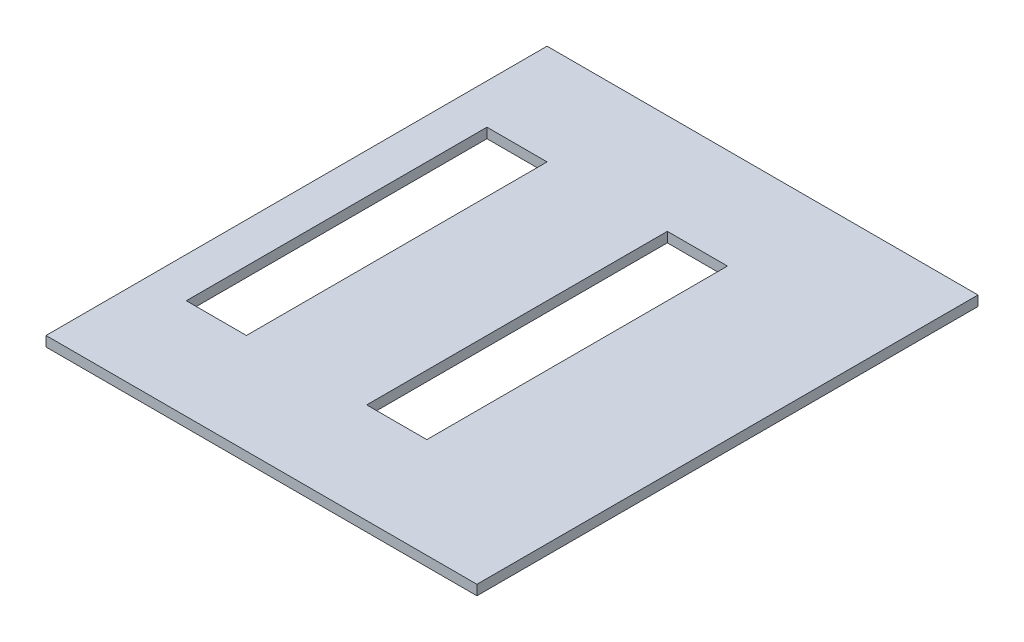
ISO-10303-21;
HEADER;
FILE_DESCRIPTION(('STEP AP214'),'2;1');
FILE_NAME('part.step','',(''),(''),'','','');
FILE_SCHEMA(('AUTOMOTIVE_DESIGN { 1 0 10303 214 1 1 1 1 }'));
ENDSEC;
DATA;
#1=APPLICATION_CONTEXT('core data for automotive mechanical design processes');
#2=APPLICATION_PROTOCOL_DEFINITION('international standard','automotive_design',2000,#1);
#3=PRODUCT_CONTEXT('',#1,'mechanical');
#4=PRODUCT('Part','Part','',(#3));
#5=PRODUCT_RELATED_PRODUCT_CATEGORY('part','',(#4));
#6=PRODUCT_DEFINITION_FORMATION('','',#4);
#7=PRODUCT_DEFINITION_CONTEXT('part definition',#1,'design');
#8=PRODUCT_DEFINITION('design','',#6,#7);
#9=PRODUCT_DEFINITION_SHAPE('','',#8);
#10=(LENGTH_UNIT() NAMED_UNIT(*) SI_UNIT(.MILLI.,.METRE.));
#11=(NAMED_UNIT(*) PLANE_ANGLE_UNIT() SI_UNIT($,.RADIAN.));
#12=(NAMED_UNIT(*) SI_UNIT($,.STERADIAN.) SOLID_ANGLE_UNIT());
#13=UNCERTAINTY_MEASURE_WITH_UNIT(LENGTH_MEASURE(1.E-05),#10,'distance_accuracy_value','');
#14=(GEOMETRIC_REPRESENTATION_CONTEXT(3) GLOBAL_UNCERTAINTY_ASSIGNED_CONTEXT((#13)) GLOBAL_UNIT_ASSIGNED_CONTEXT((#10,
#11,#12)) REPRESENTATION_CONTEXT('',''));
#15=CARTESIAN_POINT('',(0.,0.,0.));
#16=DIRECTION('',(0.,0.,1.));
#17=DIRECTION('',(1.,0.,0.));
#18=AXIS2_PLACEMENT_3D('',#15,#16,#17);
#19=CARTESIAN_POINT('',(1092.2,50.8,-1270.));
#20=DIRECTION('',(-1.,0.,0.));
#21=DIRECTION('',(0.,0.,1.));
#22=AXIS2_PLACEMENT_3D('',#19,#20,#21);
#23=PLANE('',#22);
#24=DIRECTION('',(0.,0.,-1.));
#25=VECTOR('',#24,1.);
#26=CARTESIAN_POINT('',(1092.2,0.,-1270.));
#27=LINE('',#26,#25);
#28=CARTESIAN_POINT('',(1092.2,0.,1270.));
#29=VERTEX_POINT('',#28);
#30=CARTESIAN_POINT('',(1092.2,0.,-1270.));
#31=VERTEX_POINT('',#30);
#32=EDGE_CURVE('E161',#29,#31,#27,.T.);
#33=ORIENTED_EDGE('',*,*,#32,.T.);
#34=DIRECTION('',(0.,-1.,0.));
#35=VECTOR('',#34,1.);
#36=CARTESIAN_POINT('',(1092.2,50.8,-1270.));
#37=LINE('',#36,#35);
#38=CARTESIAN_POINT('',(1092.2,50.8,-1270.));
#39=VERTEX_POINT('',#38);
#40=EDGE_CURVE('E11',#39,#31,#37,.T.);
#41=ORIENTED_EDGE('',*,*,#40,.F.);
#42=DIRECTION('',(0.,0.,-1.));
#43=VECTOR('',#42,1.);
#44=CARTESIAN_POINT('',(1092.2,50.8,-1270.));
#45=LINE('',#44,#43);
#46=CARTESIAN_POINT('',(1092.2,50.8,1270.));
#47=VERTEX_POINT('',#46);
#48=EDGE_CURVE('E190',#47,#39,#45,.T.);
#49=ORIENTED_EDGE('',*,*,#48,.F.);
#50=DIRECTION('',(0.,-1.,0.));
#51=VECTOR('',#50,1.);
#52=CARTESIAN_POINT('',(1092.2,50.8,1270.));
#53=LINE('',#52,#51);
#54=EDGE_CURVE('E200',#47,#29,#53,.T.);
#55=ORIENTED_EDGE('',*,*,#54,.T.);
#56=EDGE_LOOP('',(#33,#41,#49,#55));
#57=FACE_BOUND('',#56,.T.);
#58=ADVANCED_FACE('F38',(#57),#23,.F.);
#59=CARTESIAN_POINT('',(-1092.2,50.8,-1270.));
#60=DIRECTION('',(0.,0.,1.));
#61=DIRECTION('',(1.,0.,0.));
#62=AXIS2_PLACEMENT_3D('',#59,#60,#61);
#63=PLANE('',#62);
#64=DIRECTION('',(-1.,0.,0.));
#65=VECTOR('',#64,1.);
#66=CARTESIAN_POINT('',(-1092.2,0.,-1270.));
#67=LINE('',#66,#65);
#68=CARTESIAN_POINT('',(-1092.2,0.,-1270.));
#69=VERTEX_POINT('',#68);
#70=EDGE_CURVE('E203',#31,#69,#67,.T.);
#71=ORIENTED_EDGE('',*,*,#70,.T.);
#72=DIRECTION('',(0.,-1.,0.));
#73=VECTOR('',#72,1.);
#74=CARTESIAN_POINT('',(-1092.2,50.8,-1270.));
#75=LINE('',#74,#73);
#76=CARTESIAN_POINT('',(-1092.2,50.8,-1270.));
#77=VERTEX_POINT('',#76);
#78=EDGE_CURVE('E45',#77,#69,#75,.T.);
#79=ORIENTED_EDGE('',*,*,#78,.F.);
#80=DIRECTION('',(-1.,0.,0.));
#81=VECTOR('',#80,1.);
#82=CARTESIAN_POINT('',(-1092.2,50.8,-1270.));
#83=LINE('',#82,#81);
#84=EDGE_CURVE('E193',#39,#77,#83,.T.);
#85=ORIENTED_EDGE('',*,*,#84,.F.);
#86=ORIENTED_EDGE('',*,*,#40,.T.);
#87=EDGE_LOOP('',(#71,#79,#85,#86));
#88=FACE_BOUND('',#87,.T.);
#89=ADVANCED_FACE('F232',(#88),#63,.F.);
#90=CARTESIAN_POINT('',(-1092.2,50.8,-1270.));
#91=DIRECTION('',(1.,0.,0.));
#92=DIRECTION('',(0.,0.,-1.));
#93=AXIS2_PLACEMENT_3D('',#90,#91,#92);
#94=PLANE('',#93);
#95=DIRECTION('',(0.,0.,1.));
#96=VECTOR('',#95,1.);
#97=CARTESIAN_POINT('',(-1092.2,0.,-1270.));
#98=LINE('',#97,#96);
#99=CARTESIAN_POINT('',(-1092.2,0.,1270.));
#100=VERTEX_POINT('',#99);
#101=EDGE_CURVE('E205',#69,#100,#98,.T.);
#102=ORIENTED_EDGE('',*,*,#101,.T.);
#103=DIRECTION('',(0.,-1.,0.));
#104=VECTOR('',#103,1.);
#105=CARTESIAN_POINT('',(-1092.2,50.8,1270.));
#106=LINE('',#105,#104);
#107=CARTESIAN_POINT('',(-1092.2,50.8,1270.));
#108=VERTEX_POINT('',#107);
#109=EDGE_CURVE('E210',#108,#100,#106,.T.);
#110=ORIENTED_EDGE('',*,*,#109,.F.);
#111=DIRECTION('',(0.,0.,1.));
#112=VECTOR('',#111,1.);
#113=CARTESIAN_POINT('',(-1092.2,50.8,-1270.));
#114=LINE('',#113,#112);
#115=EDGE_CURVE('E196',#77,#108,#114,.T.);
#116=ORIENTED_EDGE('',*,*,#115,.F.);
#117=ORIENTED_EDGE('',*,*,#78,.T.);
#118=EDGE_LOOP('',(#102,#110,#116,#117));
#119=FACE_BOUND('',#118,.T.);
#120=ADVANCED_FACE('F217',(#119),#94,.F.);
#121=CARTESIAN_POINT('',(-1092.2,50.8,1270.));
#122=DIRECTION('',(0.,0.,-1.));
#123=DIRECTION('',(-1.,0.,0.));
#124=AXIS2_PLACEMENT_3D('',#121,#122,#123);
#125=PLANE('',#124);
#126=DIRECTION('',(1.,0.,0.));
#127=VECTOR('',#126,1.);
#128=CARTESIAN_POINT('',(-1092.2,0.,1270.));
#129=LINE('',#128,#127);
#130=EDGE_CURVE('E194',#100,#29,#129,.T.);
#131=ORIENTED_EDGE('',*,*,#130,.T.);
#132=ORIENTED_EDGE('',*,*,#54,.F.);
#133=DIRECTION('',(1.,0.,0.));
#134=VECTOR('',#133,1.);
#135=CARTESIAN_POINT('',(-1092.2,50.8,1270.));
#136=LINE('',#135,#134);
#137=EDGE_CURVE('E198',#108,#47,#136,.T.);
#138=ORIENTED_EDGE('',*,*,#137,.F.);
#139=ORIENTED_EDGE('',*,*,#109,.T.);
#140=EDGE_LOOP('',(#131,#132,#138,#139));
#141=FACE_BOUND('',#140,.T.);
#142=ADVANCED_FACE('F226',(#141),#125,.F.);
#143=CARTESIAN_POINT('',(0.,50.8,0.));
#144=DIRECTION('',(0.,1.,0.));
#145=DIRECTION('',(0.,0.,1.));
#146=AXIS2_PLACEMENT_3D('',#143,#144,#145);
#147=PLANE('',#146);
#148=DIRECTION('',(0.,0.,-1.));
#149=VECTOR('',#148,1.);
#150=CARTESIAN_POINT('',(330.2,50.8,762.));
#151=LINE('',#150,#149);
#152=CARTESIAN_POINT('',(330.2,50.8,762.));
#153=VERTEX_POINT('',#152);
#154=CARTESIAN_POINT('',(330.2,50.8,-762.));
#155=VERTEX_POINT('',#154);
#156=EDGE_CURVE('E52',#153,#155,#151,.T.);
#157=ORIENTED_EDGE('',*,*,#156,.F.);
#158=DIRECTION('',(1.,0.,0.));
#159=VECTOR('',#158,1.);
#160=CARTESIAN_POINT('',(25.3999999999998,50.8,762.));
#161=LINE('',#160,#159);
#162=CARTESIAN_POINT('',(25.3999999999998,50.8,762.));
#163=VERTEX_POINT('',#162);
#164=EDGE_CURVE('E150',#163,#153,#161,.T.);
#165=ORIENTED_EDGE('',*,*,#164,.F.);
#166=DIRECTION('',(0.,0.,1.));
#167=VECTOR('',#166,1.);
#168=CARTESIAN_POINT('',(25.3999999999998,50.8,762.));
#169=LINE('',#168,#167);
#170=CARTESIAN_POINT('',(25.3999999999998,50.8,-762.));
#171=VERTEX_POINT('',#170);
#172=EDGE_CURVE('E133',#171,#163,#169,.T.);
#173=ORIENTED_EDGE('',*,*,#172,.F.);
#174=DIRECTION('',(-1.,0.,0.));
#175=VECTOR('',#174,1.);
#176=CARTESIAN_POINT('',(25.3999999999998,50.8,-762.));
#177=LINE('',#176,#175);
#178=EDGE_CURVE('E143',#155,#171,#177,.T.);
#179=ORIENTED_EDGE('',*,*,#178,.F.);
#180=EDGE_LOOP('',(#157,#165,#173,#179));
#181=FACE_BOUND('',#180,.T.);
#182=DIRECTION('',(0.,0.,-1.));
#183=VECTOR('',#182,1.);
#184=CARTESIAN_POINT('',(-584.2,50.8,762.));
#185=LINE('',#184,#183);
#186=CARTESIAN_POINT('',(-584.2,50.8,762.));
#187=VERTEX_POINT('',#186);
#188=CARTESIAN_POINT('',(-584.2,50.8,-762.));
#189=VERTEX_POINT('',#188);
#190=EDGE_CURVE('E60',#187,#189,#185,.T.);
#191=ORIENTED_EDGE('',*,*,#190,.F.);
#192=DIRECTION('',(1.,0.,0.));
#193=VECTOR('',#192,1.);
#194=CARTESIAN_POINT('',(-889.,50.8,762.));
#195=LINE('',#194,#193);
#196=CARTESIAN_POINT('',(-889.,50.8,762.));
#197=VERTEX_POINT('',#196);
#198=EDGE_CURVE('E179',#197,#187,#195,.T.);
#199=ORIENTED_EDGE('',*,*,#198,.F.);
#200=DIRECTION('',(0.,0.,1.));
#201=VECTOR('',#200,1.);
#202=CARTESIAN_POINT('',(-889.,50.8,762.));
#203=LINE('',#202,#201);
#204=CARTESIAN_POINT('',(-889.,50.8,-762.));
#205=VERTEX_POINT('',#204);
#206=EDGE_CURVE('E176',#205,#197,#203,.T.);
#207=ORIENTED_EDGE('',*,*,#206,.F.);
#208=DIRECTION('',(-1.,0.,0.));
#209=VECTOR('',#208,1.);
#210=CARTESIAN_POINT('',(-889.,50.8,-762.));
#211=LINE('',#210,#209);
#212=EDGE_CURVE('E173',#189,#205,#211,.T.);
#213=ORIENTED_EDGE('',*,*,#212,.F.);
#214=EDGE_LOOP('',(#191,#199,#207,#213));
#215=FACE_BOUND('',#214,.T.);
#216=ORIENTED_EDGE('',*,*,#48,.T.);
#217=ORIENTED_EDGE('',*,*,#84,.T.);
#218=ORIENTED_EDGE('',*,*,#115,.T.);
#219=ORIENTED_EDGE('',*,*,#137,.T.);
#220=EDGE_LOOP('',(#216,#217,#218,#219));
#221=FACE_BOUND('',#220,.T.);
#222=ADVANCED_FACE('F147',(#181,#215,#221),#147,.T.);
#223=CARTESIAN_POINT('',(0.,0.,0.));
#224=DIRECTION('',(0.,1.,0.));
#225=DIRECTION('',(0.,0.,1.));
#226=AXIS2_PLACEMENT_3D('',#223,#224,#225);
#227=PLANE('',#226);
#228=DIRECTION('',(-1.,0.,0.));
#229=VECTOR('',#228,1.);
#230=CARTESIAN_POINT('',(25.3999999999998,0.,762.));
#231=LINE('',#230,#229);
#232=CARTESIAN_POINT('',(330.2,0.,762.));
#233=VERTEX_POINT('',#232);
#234=CARTESIAN_POINT('',(25.3999999999998,0.,762.));
#235=VERTEX_POINT('',#234);
#236=EDGE_CURVE('E276',#233,#235,#231,.T.);
#237=ORIENTED_EDGE('',*,*,#236,.F.);
#238=DIRECTION('',(0.,0.,1.));
#239=VECTOR('',#238,1.);
#240=CARTESIAN_POINT('',(330.2,0.,762.));
#241=LINE('',#240,#239);
#242=CARTESIAN_POINT('',(330.2,0.,-762.));
#243=VERTEX_POINT('',#242);
#244=EDGE_CURVE('E162',#243,#233,#241,.T.);
#245=ORIENTED_EDGE('',*,*,#244,.F.);
#246=DIRECTION('',(1.,0.,0.));
#247=VECTOR('',#246,1.);
#248=CARTESIAN_POINT('',(25.3999999999998,0.,-762.));
#249=LINE('',#248,#247);
#250=CARTESIAN_POINT('',(25.3999999999998,0.,-762.));
#251=VERTEX_POINT('',#250);
#252=EDGE_CURVE('E159',#251,#243,#249,.T.);
#253=ORIENTED_EDGE('',*,*,#252,.F.);
#254=DIRECTION('',(0.,0.,-1.));
#255=VECTOR('',#254,1.);
#256=CARTESIAN_POINT('',(25.3999999999998,0.,762.));
#257=LINE('',#256,#255);
#258=EDGE_CURVE('E136',#235,#251,#257,.T.);
#259=ORIENTED_EDGE('',*,*,#258,.F.);
#260=EDGE_LOOP('',(#237,#245,#253,#259));
#261=FACE_BOUND('',#260,.T.);
#262=DIRECTION('',(-1.,0.,0.));
#263=VECTOR('',#262,1.);
#264=CARTESIAN_POINT('',(-889.,0.,762.));
#265=LINE('',#264,#263);
#266=CARTESIAN_POINT('',(-584.2,0.,762.));
#267=VERTEX_POINT('',#266);
#268=CARTESIAN_POINT('',(-889.,0.,762.));
#269=VERTEX_POINT('',#268);
#270=EDGE_CURVE('E166',#267,#269,#265,.T.);
#271=ORIENTED_EDGE('',*,*,#270,.F.);
#272=DIRECTION('',(0.,0.,1.));
#273=VECTOR('',#272,1.);
#274=CARTESIAN_POINT('',(-584.2,0.,762.));
#275=LINE('',#274,#273);
#276=CARTESIAN_POINT('',(-584.2,0.,-762.));
#277=VERTEX_POINT('',#276);
#278=EDGE_CURVE('E169',#277,#267,#275,.T.);
#279=ORIENTED_EDGE('',*,*,#278,.F.);
#280=DIRECTION('',(1.,0.,0.));
#281=VECTOR('',#280,1.);
#282=CARTESIAN_POINT('',(-889.,0.,-762.));
#283=LINE('',#282,#281);
#284=CARTESIAN_POINT('',(-889.,0.,-762.));
#285=VERTEX_POINT('',#284);
#286=EDGE_CURVE('E171',#285,#277,#283,.T.);
#287=ORIENTED_EDGE('',*,*,#286,.F.);
#288=DIRECTION('',(0.,0.,-1.));
#289=VECTOR('',#288,1.);
#290=CARTESIAN_POINT('',(-889.,0.,762.));
#291=LINE('',#290,#289);
#292=EDGE_CURVE('E163',#269,#285,#291,.T.);
#293=ORIENTED_EDGE('',*,*,#292,.F.);
#294=EDGE_LOOP('',(#271,#279,#287,#293));
#295=FACE_BOUND('',#294,.T.);
#296=ORIENTED_EDGE('',*,*,#32,.F.);
#297=ORIENTED_EDGE('',*,*,#130,.F.);
#298=ORIENTED_EDGE('',*,*,#101,.F.);
#299=ORIENTED_EDGE('',*,*,#70,.F.);
#300=EDGE_LOOP('',(#296,#297,#298,#299));
#301=FACE_BOUND('',#300,.T.);
#302=ADVANCED_FACE('F223',(#261,#295,#301),#227,.F.);
#303=CARTESIAN_POINT('',(-584.2,-1554.18114774308,762.));
#304=DIRECTION('',(1.,0.,0.));
#305=DIRECTION('',(0.,0.,-1.));
#306=AXIS2_PLACEMENT_3D('',#303,#304,#305);
#307=PLANE('',#306);
#308=ORIENTED_EDGE('',*,*,#278,.T.);
#309=DIRECTION('',(0.,1.,0.));
#310=VECTOR('',#309,1.);
#311=CARTESIAN_POINT('',(-584.2,-1554.18114774308,762.));
#312=LINE('',#311,#310);
#313=EDGE_CURVE('E167',#267,#187,#312,.T.);
#314=ORIENTED_EDGE('',*,*,#313,.T.);
#315=ORIENTED_EDGE('',*,*,#190,.T.);
#316=DIRECTION('',(0.,1.,0.));
#317=VECTOR('',#316,1.);
#318=CARTESIAN_POINT('',(-584.2,-1554.18114774308,-762.));
#319=LINE('',#318,#317);
#320=EDGE_CURVE('E182',#277,#189,#319,.T.);
#321=ORIENTED_EDGE('',*,*,#320,.F.);
#322=EDGE_LOOP('',(#308,#314,#315,#321));
#323=FACE_BOUND('',#322,.T.);
#324=ADVANCED_FACE('F244',(#323),#307,.F.);
#325=CARTESIAN_POINT('',(-889.,-1554.18114774308,762.));
#326=DIRECTION('',(0.,0.,1.));
#327=DIRECTION('',(1.,0.,0.));
#328=AXIS2_PLACEMENT_3D('',#325,#326,#327);
#329=PLANE('',#328);
#330=ORIENTED_EDGE('',*,*,#270,.T.);
#331=DIRECTION('',(0.,1.,0.));
#332=VECTOR('',#331,1.);
#333=CARTESIAN_POINT('',(-889.,-1554.18114774308,762.));
#334=LINE('',#333,#332);
#335=EDGE_CURVE('E184',#269,#197,#334,.T.);
#336=ORIENTED_EDGE('',*,*,#335,.T.);
#337=ORIENTED_EDGE('',*,*,#198,.T.);
#338=ORIENTED_EDGE('',*,*,#313,.F.);
#339=EDGE_LOOP('',(#330,#336,#337,#338));
#340=FACE_BOUND('',#339,.T.);
#341=ADVANCED_FACE('F250',(#340),#329,.F.);
#342=CARTESIAN_POINT('',(-889.,-1554.18114774308,762.));
#343=DIRECTION('',(-1.,0.,0.));
#344=DIRECTION('',(0.,0.,1.));
#345=AXIS2_PLACEMENT_3D('',#342,#343,#344);
#346=PLANE('',#345);
#347=ORIENTED_EDGE('',*,*,#292,.T.);
#348=DIRECTION('',(0.,1.,0.));
#349=VECTOR('',#348,1.);
#350=CARTESIAN_POINT('',(-889.,-1554.18114774308,-762.));
#351=LINE('',#350,#349);
#352=EDGE_CURVE('E186',#285,#205,#351,.T.);
#353=ORIENTED_EDGE('',*,*,#352,.T.);
#354=ORIENTED_EDGE('',*,*,#206,.T.);
#355=ORIENTED_EDGE('',*,*,#335,.F.);
#356=EDGE_LOOP('',(#347,#353,#354,#355));
#357=FACE_BOUND('',#356,.T.);
#358=ADVANCED_FACE('F255',(#357),#346,.F.);
#359=CARTESIAN_POINT('',(-889.,-1554.18114774308,-762.));
#360=DIRECTION('',(0.,0.,-1.));
#361=DIRECTION('',(-1.,0.,0.));
#362=AXIS2_PLACEMENT_3D('',#359,#360,#361);
#363=PLANE('',#362);
#364=ORIENTED_EDGE('',*,*,#286,.T.);
#365=ORIENTED_EDGE('',*,*,#320,.T.);
#366=ORIENTED_EDGE('',*,*,#212,.T.);
#367=ORIENTED_EDGE('',*,*,#352,.F.);
#368=EDGE_LOOP('',(#364,#365,#366,#367));
#369=FACE_BOUND('',#368,.T.);
#370=ADVANCED_FACE('F251',(#369),#363,.F.);
#371=CARTESIAN_POINT('',(330.2,-1554.18114774308,762.));
#372=DIRECTION('',(1.,0.,0.));
#373=DIRECTION('',(0.,0.,-1.));
#374=AXIS2_PLACEMENT_3D('',#371,#372,#373);
#375=PLANE('',#374);
#376=ORIENTED_EDGE('',*,*,#244,.T.);
#377=DIRECTION('',(0.,1.,0.));
#378=VECTOR('',#377,1.);
#379=CARTESIAN_POINT('',(330.2,-1554.18114774308,762.));
#380=LINE('',#379,#378);
#381=EDGE_CURVE('E155',#233,#153,#380,.T.);
#382=ORIENTED_EDGE('',*,*,#381,.T.);
#383=ORIENTED_EDGE('',*,*,#156,.T.);
#384=DIRECTION('',(0.,1.,0.));
#385=VECTOR('',#384,1.);
#386=CARTESIAN_POINT('',(330.2,-1554.18114774308,-762.));
#387=LINE('',#386,#385);
#388=EDGE_CURVE('E140',#243,#155,#387,.T.);
#389=ORIENTED_EDGE('',*,*,#388,.F.);
#390=EDGE_LOOP('',(#376,#382,#383,#389));
#391=FACE_BOUND('',#390,.T.);
#392=ADVANCED_FACE('F254',(#391),#375,.F.);
#393=CARTESIAN_POINT('',(25.3999999999998,-1554.18114774308,762.));
#394=DIRECTION('',(0.,0.,1.));
#395=DIRECTION('',(1.,0.,0.));
#396=AXIS2_PLACEMENT_3D('',#393,#394,#395);
#397=PLANE('',#396);
#398=ORIENTED_EDGE('',*,*,#236,.T.);
#399=DIRECTION('',(0.,1.,0.));
#400=VECTOR('',#399,1.);
#401=CARTESIAN_POINT('',(25.3999999999998,-1554.18114774308,762.));
#402=LINE('',#401,#400);
#403=EDGE_CURVE('E139',#235,#163,#402,.T.);
#404=ORIENTED_EDGE('',*,*,#403,.T.);
#405=ORIENTED_EDGE('',*,*,#164,.T.);
#406=ORIENTED_EDGE('',*,*,#381,.F.);
#407=EDGE_LOOP('',(#398,#404,#405,#406));
#408=FACE_BOUND('',#407,.T.);
#409=ADVANCED_FACE('F265',(#408),#397,.F.);
#410=CARTESIAN_POINT('',(25.3999999999998,-1554.18114774308,762.));
#411=DIRECTION('',(-1.,0.,0.));
#412=DIRECTION('',(0.,0.,1.));
#413=AXIS2_PLACEMENT_3D('',#410,#411,#412);
#414=PLANE('',#413);
#415=ORIENTED_EDGE('',*,*,#258,.T.);
#416=DIRECTION('',(0.,1.,0.));
#417=VECTOR('',#416,1.);
#418=CARTESIAN_POINT('',(25.3999999999998,-1554.18114774308,-762.));
#419=LINE('',#418,#417);
#420=EDGE_CURVE('E128',#251,#171,#419,.T.);
#421=ORIENTED_EDGE('',*,*,#420,.T.);
#422=ORIENTED_EDGE('',*,*,#172,.T.);
#423=ORIENTED_EDGE('',*,*,#403,.F.);
#424=EDGE_LOOP('',(#415,#421,#422,#423));
#425=FACE_BOUND('',#424,.T.);
#426=ADVANCED_FACE('F130',(#425),#414,.F.);
#427=CARTESIAN_POINT('',(25.3999999999998,-1554.18114774308,-762.));
#428=DIRECTION('',(0.,0.,-1.));
#429=DIRECTION('',(-1.,0.,0.));
#430=AXIS2_PLACEMENT_3D('',#427,#428,#429);
#431=PLANE('',#430);
#432=ORIENTED_EDGE('',*,*,#252,.T.);
#433=ORIENTED_EDGE('',*,*,#388,.T.);
#434=ORIENTED_EDGE('',*,*,#178,.T.);
#435=ORIENTED_EDGE('',*,*,#420,.F.);
#436=EDGE_LOOP('',(#432,#433,#434,#435));
#437=FACE_BOUND('',#436,.T.);
#438=ADVANCED_FACE('F144',(#437),#431,.F.);
#439=CLOSED_SHELL('',(#58,#89,#120,#142,#222,#302,#324,#341,#358,#370,#392,#409,#426,#438));
#440=MANIFOLD_SOLID_BREP('B2',#439);
#441=ADVANCED_BREP_SHAPE_REPRESENTATION('',(#18,#440),#14);
#442=SHAPE_DEFINITION_REPRESENTATION(#9,#441);
ENDSEC;
END-ISO-10303-21;
